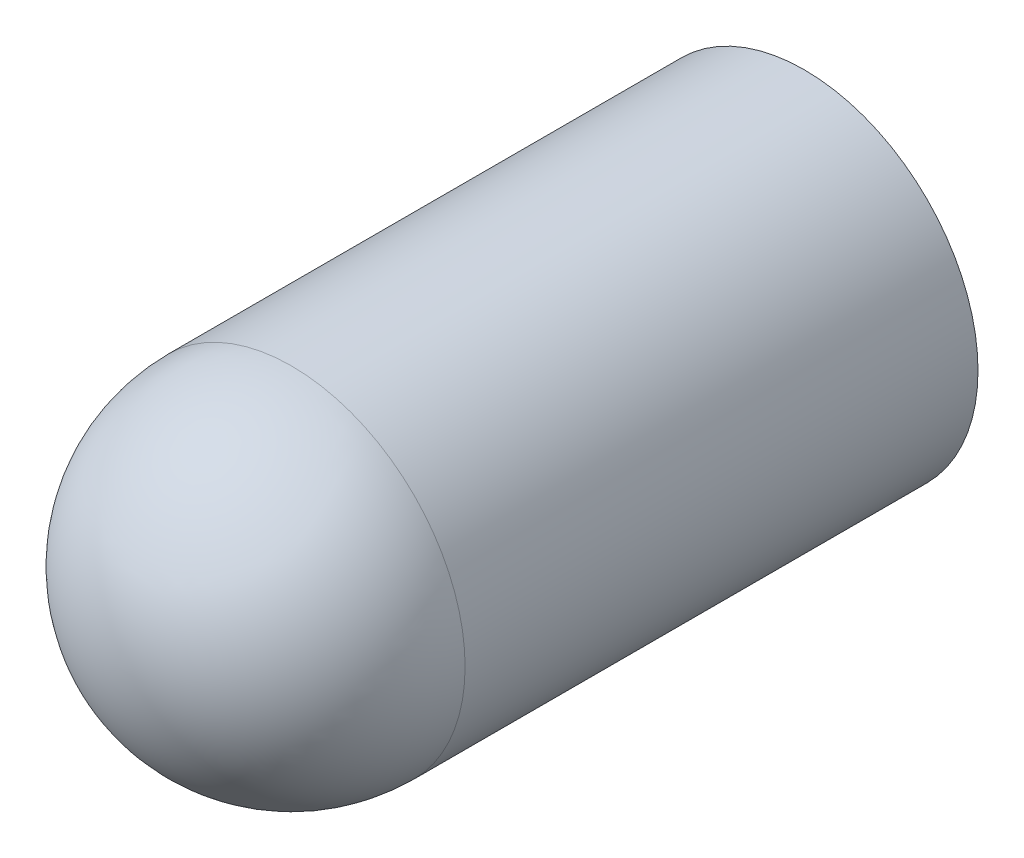
ISO-10303-21;
HEADER;
FILE_DESCRIPTION(('STEP AP214'),'2;1');
FILE_NAME('part.step','',(''),(''),'','','');
FILE_SCHEMA(('AUTOMOTIVE_DESIGN { 1 0 10303 214 1 1 1 1 }'));
ENDSEC;
DATA;
#1=APPLICATION_CONTEXT('core data for automotive mechanical design processes');
#2=APPLICATION_PROTOCOL_DEFINITION('international standard','automotive_design',2000,#1);
#3=PRODUCT_CONTEXT('',#1,'mechanical');
#4=PRODUCT('Part','Part','',(#3));
#5=PRODUCT_RELATED_PRODUCT_CATEGORY('part','',(#4));
#6=PRODUCT_DEFINITION_FORMATION('','',#4);
#7=PRODUCT_DEFINITION_CONTEXT('part definition',#1,'design');
#8=PRODUCT_DEFINITION('design','',#6,#7);
#9=PRODUCT_DEFINITION_SHAPE('','',#8);
#10=(LENGTH_UNIT() NAMED_UNIT(*) SI_UNIT(.MILLI.,.METRE.));
#11=(NAMED_UNIT(*) PLANE_ANGLE_UNIT() SI_UNIT($,.RADIAN.));
#12=(NAMED_UNIT(*) SI_UNIT($,.STERADIAN.) SOLID_ANGLE_UNIT());
#13=UNCERTAINTY_MEASURE_WITH_UNIT(LENGTH_MEASURE(1.E-05),#10,'distance_accuracy_value','');
#14=(GEOMETRIC_REPRESENTATION_CONTEXT(3) GLOBAL_UNCERTAINTY_ASSIGNED_CONTEXT((#13)) GLOBAL_UNIT_ASSIGNED_CONTEXT((#10,
#11,#12)) REPRESENTATION_CONTEXT('',''));
#15=CARTESIAN_POINT('',(0.,0.,0.));
#16=DIRECTION('',(0.,0.,1.));
#17=DIRECTION('',(1.,0.,0.));
#18=AXIS2_PLACEMENT_3D('',#15,#16,#17);
#19=CARTESIAN_POINT('',(1.27,0.,0.));
#20=DIRECTION('',(0.,0.,1.));
#21=DIRECTION('',(1.,0.,0.));
#22=AXIS2_PLACEMENT_3D('',#19,#20,#21);
#23=PLANE('',#22);
#24=CARTESIAN_POINT('',(0.,0.,0.));
#25=DIRECTION('',(0.,0.,-1.));
#26=DIRECTION('',(-1.,0.,0.));
#27=AXIS2_PLACEMENT_3D('',#24,#25,#26);
#28=CIRCLE('',#27,1.27);
#29=CARTESIAN_POINT('',(-1.27,0.,0.));
#30=VERTEX_POINT('',#29);
#31=EDGE_CURVE('E46',#30,#30,#28,.T.);
#32=ORIENTED_EDGE('',*,*,#31,.F.);
#33=EDGE_LOOP('',(#32));
#34=FACE_BOUND('',#33,.T.);
#35=CARTESIAN_POINT('',(0.,0.,0.));
#36=DIRECTION('',(0.,0.,-1.));
#37=DIRECTION('',(-1.,0.,0.));
#38=AXIS2_PLACEMENT_3D('',#35,#36,#37);
#39=CIRCLE('',#38,2.794);
#40=CARTESIAN_POINT('',(-2.794,0.,0.));
#41=VERTEX_POINT('',#40);
#42=EDGE_CURVE('E10',#41,#41,#39,.T.);
#43=ORIENTED_EDGE('',*,*,#42,.T.);
#44=EDGE_LOOP('',(#43));
#45=FACE_BOUND('',#44,.T.);
#46=ADVANCED_FACE('F32',(#34,#45),#23,.F.);
#47=CARTESIAN_POINT('',(0.,0.,0.));
#48=DIRECTION('',(0.,0.,-1.));
#49=DIRECTION('',(-1.,0.,0.));
#50=AXIS2_PLACEMENT_3D('',#47,#48,#49);
#51=CYLINDRICAL_SURFACE('',#50,2.794);
#52=ORIENTED_EDGE('',*,*,#42,.F.);
#53=EDGE_LOOP('',(#52));
#54=FACE_BOUND('',#53,.T.);
#55=CARTESIAN_POINT('',(0.,0.,8.255));
#56=DIRECTION('',(0.,0.,-1.));
#57=DIRECTION('',(-1.,0.,0.));
#58=AXIS2_PLACEMENT_3D('',#55,#56,#57);
#59=CIRCLE('',#58,2.794);
#60=CARTESIAN_POINT('',(-2.794,0.,8.255));
#61=VERTEX_POINT('',#60);
#62=EDGE_CURVE('E38',#61,#61,#59,.T.);
#63=ORIENTED_EDGE('',*,*,#62,.T.);
#64=EDGE_LOOP('',(#63));
#65=FACE_BOUND('',#64,.T.);
#66=ADVANCED_FACE('F55',(#54,#65),#51,.T.);
#67=CARTESIAN_POINT('',(0.,0.,8.255));
#68=DIRECTION('',(0.,0.,-1.));
#69=DIRECTION('',(-1.,0.,0.));
#70=AXIS2_PLACEMENT_3D('',#67,#68,#69);
#71=SPHERICAL_SURFACE('',#70,2.794);
#72=ORIENTED_EDGE('',*,*,#62,.F.);
#73=EDGE_LOOP('',(#72));
#74=FACE_BOUND('',#73,.T.);
#75=ADVANCED_FACE('F59',(#74),#71,.T.);
#76=CARTESIAN_POINT('',(0.,0.,8.255));
#77=DIRECTION('',(0.,0.,-1.));
#78=DIRECTION('',(1.,0.,0.));
#79=AXIS2_PLACEMENT_3D('',#76,#77,#78);
#80=SPHERICAL_SURFACE('',#79,1.27);
#81=CARTESIAN_POINT('',(0.,0.,8.255));
#82=DIRECTION('',(0.,0.,-1.));
#83=DIRECTION('',(-1.,0.,0.));
#84=AXIS2_PLACEMENT_3D('',#81,#82,#83);
#85=CIRCLE('',#84,1.27);
#86=CARTESIAN_POINT('',(-1.27,0.,8.255));
#87=VERTEX_POINT('',#86);
#88=EDGE_CURVE('E42',#87,#87,#85,.T.);
#89=ORIENTED_EDGE('',*,*,#88,.T.);
#90=EDGE_LOOP('',(#89));
#91=FACE_BOUND('',#90,.T.);
#92=ADVANCED_FACE('F64',(#91),#80,.F.);
#93=CARTESIAN_POINT('',(0.,0.,0.));
#94=DIRECTION('',(0.,0.,-1.));
#95=DIRECTION('',(-1.,0.,0.));
#96=AXIS2_PLACEMENT_3D('',#93,#94,#95);
#97=CYLINDRICAL_SURFACE('',#96,1.27);
#98=ORIENTED_EDGE('',*,*,#88,.F.);
#99=EDGE_LOOP('',(#98));
#100=FACE_BOUND('',#99,.T.);
#101=ORIENTED_EDGE('',*,*,#31,.T.);
#102=EDGE_LOOP('',(#101));
#103=FACE_BOUND('',#102,.T.);
#104=ADVANCED_FACE('F52',(#100,#103),#97,.F.);
#105=CLOSED_SHELL('',(#46,#66,#75,#92,#104));
#106=MANIFOLD_SOLID_BREP('B2',#105);
#107=ADVANCED_BREP_SHAPE_REPRESENTATION('',(#18,#106),#14);
#108=SHAPE_DEFINITION_REPRESENTATION(#9,#107);
ENDSEC;
END-ISO-10303-21;
